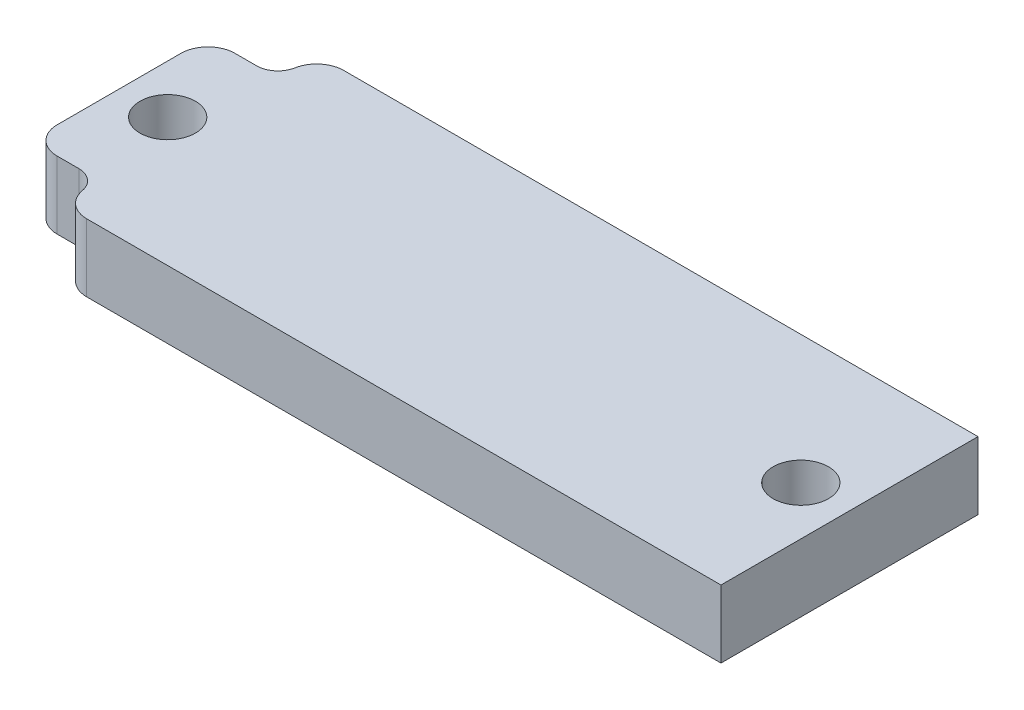
ISO-10303-21;
HEADER;
FILE_DESCRIPTION(('STEP AP214'),'2;1');
FILE_NAME('part.step','',(''),(''),'','','');
FILE_SCHEMA(('AUTOMOTIVE_DESIGN { 1 0 10303 214 1 1 1 1 }'));
ENDSEC;
DATA;
#1=APPLICATION_CONTEXT('core data for automotive mechanical design processes');
#2=APPLICATION_PROTOCOL_DEFINITION('international standard','automotive_design',2000,#1);
#3=PRODUCT_CONTEXT('',#1,'mechanical');
#4=PRODUCT('Part','Part','',(#3));
#5=PRODUCT_RELATED_PRODUCT_CATEGORY('part','',(#4));
#6=PRODUCT_DEFINITION_FORMATION('','',#4);
#7=PRODUCT_DEFINITION_CONTEXT('part definition',#1,'design');
#8=PRODUCT_DEFINITION('design','',#6,#7);
#9=PRODUCT_DEFINITION_SHAPE('','',#8);
#10=(LENGTH_UNIT() NAMED_UNIT(*) SI_UNIT(.MILLI.,.METRE.));
#11=(NAMED_UNIT(*) PLANE_ANGLE_UNIT() SI_UNIT($,.RADIAN.));
#12=(NAMED_UNIT(*) SI_UNIT($,.STERADIAN.) SOLID_ANGLE_UNIT());
#13=UNCERTAINTY_MEASURE_WITH_UNIT(LENGTH_MEASURE(1.E-05),#10,'distance_accuracy_value','');
#14=(GEOMETRIC_REPRESENTATION_CONTEXT(3) GLOBAL_UNCERTAINTY_ASSIGNED_CONTEXT((#13)) GLOBAL_UNIT_ASSIGNED_CONTEXT((#10,
#11,#12)) REPRESENTATION_CONTEXT('',''));
#15=CARTESIAN_POINT('',(0.,0.,0.));
#16=DIRECTION('',(0.,0.,1.));
#17=DIRECTION('',(1.,0.,0.));
#18=AXIS2_PLACEMENT_3D('',#15,#16,#17);
#19=CARTESIAN_POINT('',(0.,6.35,0.));
#20=DIRECTION('',(0.,-1.,0.));
#21=DIRECTION('',(0.,0.,-1.));
#22=AXIS2_PLACEMENT_3D('',#19,#20,#21);
#23=PLANE('',#22);
#24=CARTESIAN_POINT('',(4.57,6.35,-12.065));
#25=DIRECTION('',(0.,1.,0.));
#26=DIRECTION('',(0.,0.,1.));
#27=AXIS2_PLACEMENT_3D('',#24,#25,#26);
#28=CIRCLE('',#27,2.6);
#29=CARTESIAN_POINT('',(4.57,6.35,-9.465));
#30=VERTEX_POINT('',#29);
#31=EDGE_CURVE('E171',#30,#30,#28,.T.);
#32=ORIENTED_EDGE('',*,*,#31,.F.);
#33=EDGE_LOOP('',(#32));
#34=FACE_BOUND('',#33,.T.);
#35=CARTESIAN_POINT('',(64.01,6.35,-12.065));
#36=DIRECTION('',(0.,1.,0.));
#37=DIRECTION('',(0.,0.,1.));
#38=AXIS2_PLACEMENT_3D('',#35,#36,#37);
#39=CIRCLE('',#38,2.59999999999999);
#40=CARTESIAN_POINT('',(64.01,6.35,-9.46500000000001));
#41=VERTEX_POINT('',#40);
#42=EDGE_CURVE('E165',#41,#41,#39,.T.);
#43=ORIENTED_EDGE('',*,*,#42,.F.);
#44=EDGE_LOOP('',(#43));
#45=FACE_BOUND('',#44,.T.);
#46=CARTESIAN_POINT('',(4.57,6.35,-1.715));
#47=DIRECTION('',(0.,1.,0.));
#48=DIRECTION('',(0.,0.,1.));
#49=AXIS2_PLACEMENT_3D('',#46,#47,#48);
#50=CIRCLE('',#49,2.);
#51=CARTESIAN_POINT('',(4.57,6.35,-3.715));
#52=VERTEX_POINT('',#51);
#53=CARTESIAN_POINT('',(6.53670134597141,6.35,-2.07843612334802));
#54=VERTEX_POINT('',#53);
#55=EDGE_CURVE('E137',#52,#54,#50,.F.);
#56=ORIENTED_EDGE('',*,*,#55,.T.);
#57=CARTESIAN_POINT('',(9.03441205535511,6.35,-2.54));
#58=DIRECTION('',(0.,-1.,0.));
#59=DIRECTION('',(0.,0.,-1.));
#60=AXIS2_PLACEMENT_3D('',#57,#58,#59);
#61=CIRCLE('',#60,2.54);
#62=CARTESIAN_POINT('',(9.03441205535511,6.35,0.));
#63=VERTEX_POINT('',#62);
#64=EDGE_CURVE('E210',#54,#63,#61,.F.);
#65=ORIENTED_EDGE('',*,*,#64,.T.);
#66=DIRECTION('',(1.,0.,0.));
#67=VECTOR('',#66,1.);
#68=CARTESIAN_POINT('',(0.,6.35,0.));
#69=LINE('',#68,#67);
#70=CARTESIAN_POINT('',(68.58,6.35,0.));
#71=VERTEX_POINT('',#70);
#72=EDGE_CURVE('E180',#63,#71,#69,.T.);
#73=ORIENTED_EDGE('',*,*,#72,.T.);
#74=DIRECTION('',(0.,0.,-1.));
#75=VECTOR('',#74,1.);
#76=CARTESIAN_POINT('',(68.58,6.35,0.));
#77=LINE('',#76,#75);
#78=CARTESIAN_POINT('',(68.58,6.35,-24.13));
#79=VERTEX_POINT('',#78);
#80=EDGE_CURVE('E183',#71,#79,#77,.T.);
#81=ORIENTED_EDGE('',*,*,#80,.T.);
#82=DIRECTION('',(-1.,0.,0.));
#83=VECTOR('',#82,1.);
#84=CARTESIAN_POINT('',(0.,6.35,-24.13));
#85=LINE('',#84,#83);
#86=CARTESIAN_POINT('',(9.03441205535511,6.35,-24.13));
#87=VERTEX_POINT('',#86);
#88=EDGE_CURVE('E185',#79,#87,#85,.T.);
#89=ORIENTED_EDGE('',*,*,#88,.T.);
#90=CARTESIAN_POINT('',(9.03441205535511,6.35,-21.59));
#91=DIRECTION('',(0.,-1.,0.));
#92=DIRECTION('',(0.,0.,-1.));
#93=AXIS2_PLACEMENT_3D('',#90,#91,#92);
#94=CIRCLE('',#93,2.54);
#95=CARTESIAN_POINT('',(6.53670134597141,6.35,-22.051563876652));
#96=VERTEX_POINT('',#95);
#97=EDGE_CURVE('E204',#87,#96,#94,.F.);
#98=ORIENTED_EDGE('',*,*,#97,.T.);
#99=CARTESIAN_POINT('',(4.57,6.35,-22.415));
#100=DIRECTION('',(0.,1.,0.));
#101=DIRECTION('',(0.,0.,1.));
#102=AXIS2_PLACEMENT_3D('',#99,#100,#101);
#103=CIRCLE('',#102,2.);
#104=CARTESIAN_POINT('',(4.57,6.35,-20.415));
#105=VERTEX_POINT('',#104);
#106=EDGE_CURVE('E148',#105,#96,#103,.T.);
#107=ORIENTED_EDGE('',*,*,#106,.F.);
#108=DIRECTION('',(-1.,0.,0.));
#109=VECTOR('',#108,1.);
#110=CARTESIAN_POINT('',(0.,6.35,-20.415));
#111=LINE('',#110,#109);
#112=CARTESIAN_POINT('',(2.54,6.35,-20.415));
#113=VERTEX_POINT('',#112);
#114=EDGE_CURVE('E133',#105,#113,#111,.T.);
#115=ORIENTED_EDGE('',*,*,#114,.T.);
#116=CARTESIAN_POINT('',(2.54,6.35,-17.875));
#117=DIRECTION('',(0.,-1.,0.));
#118=DIRECTION('',(0.,0.,-1.));
#119=AXIS2_PLACEMENT_3D('',#116,#117,#118);
#120=CIRCLE('',#119,2.54);
#121=CARTESIAN_POINT('',(0.,6.35,-17.875));
#122=VERTEX_POINT('',#121);
#123=EDGE_CURVE('E206',#113,#122,#120,.F.);
#124=ORIENTED_EDGE('',*,*,#123,.T.);
#125=DIRECTION('',(0.,0.,1.));
#126=VECTOR('',#125,1.);
#127=CARTESIAN_POINT('',(0.,6.35,0.));
#128=LINE('',#127,#126);
#129=CARTESIAN_POINT('',(0.,6.35,-6.255));
#130=VERTEX_POINT('',#129);
#131=EDGE_CURVE('E177',#122,#130,#128,.T.);
#132=ORIENTED_EDGE('',*,*,#131,.T.);
#133=CARTESIAN_POINT('',(2.54,6.35,-6.255));
#134=DIRECTION('',(0.,-1.,0.));
#135=DIRECTION('',(0.,0.,-1.));
#136=AXIS2_PLACEMENT_3D('',#133,#134,#135);
#137=CIRCLE('',#136,2.54);
#138=CARTESIAN_POINT('',(2.54,6.35,-3.715));
#139=VERTEX_POINT('',#138);
#140=EDGE_CURVE('E208',#130,#139,#137,.F.);
#141=ORIENTED_EDGE('',*,*,#140,.T.);
#142=DIRECTION('',(-1.,0.,0.));
#143=VECTOR('',#142,1.);
#144=CARTESIAN_POINT('',(0.,6.35,-3.715));
#145=LINE('',#144,#143);
#146=EDGE_CURVE('E157',#52,#139,#145,.T.);
#147=ORIENTED_EDGE('',*,*,#146,.F.);
#148=EDGE_LOOP('',(#56,#65,#73,#81,#89,#98,#107,#115,#124,#132,#141,#147));
#149=FACE_BOUND('',#148,.T.);
#150=ADVANCED_FACE('F33',(#34,#45,#149),#23,.F.);
#151=CARTESIAN_POINT('',(0.,0.,0.));
#152=DIRECTION('',(0.,-1.,0.));
#153=DIRECTION('',(0.,0.,-1.));
#154=AXIS2_PLACEMENT_3D('',#151,#152,#153);
#155=PLANE('',#154);
#156=CARTESIAN_POINT('',(4.57,0.,-12.065));
#157=DIRECTION('',(0.,1.,0.));
#158=DIRECTION('',(0.,0.,1.));
#159=AXIS2_PLACEMENT_3D('',#156,#157,#158);
#160=CIRCLE('',#159,2.6);
#161=CARTESIAN_POINT('',(4.57,0.,-9.465));
#162=VERTEX_POINT('',#161);
#163=EDGE_CURVE('E168',#162,#162,#160,.T.);
#164=ORIENTED_EDGE('',*,*,#163,.T.);
#165=EDGE_LOOP('',(#164));
#166=FACE_BOUND('',#165,.T.);
#167=CARTESIAN_POINT('',(64.01,0.,-12.065));
#168=DIRECTION('',(0.,1.,0.));
#169=DIRECTION('',(0.,0.,1.));
#170=AXIS2_PLACEMENT_3D('',#167,#168,#169);
#171=CIRCLE('',#170,2.59999999999999);
#172=CARTESIAN_POINT('',(64.01,0.,-9.46500000000001));
#173=VERTEX_POINT('',#172);
#174=EDGE_CURVE('E164',#173,#173,#171,.T.);
#175=ORIENTED_EDGE('',*,*,#174,.T.);
#176=EDGE_LOOP('',(#175));
#177=FACE_BOUND('',#176,.T.);
#178=DIRECTION('',(1.,0.,0.));
#179=VECTOR('',#178,1.);
#180=CARTESIAN_POINT('',(0.,0.,0.));
#181=LINE('',#180,#179);
#182=CARTESIAN_POINT('',(9.03441205535511,0.,0.));
#183=VERTEX_POINT('',#182);
#184=CARTESIAN_POINT('',(68.58,0.,0.));
#185=VERTEX_POINT('',#184);
#186=EDGE_CURVE('E191',#183,#185,#181,.T.);
#187=ORIENTED_EDGE('',*,*,#186,.F.);
#188=CARTESIAN_POINT('',(9.03441205535511,0.,-2.54));
#189=DIRECTION('',(0.,-1.,0.));
#190=DIRECTION('',(0.,0.,-1.));
#191=AXIS2_PLACEMENT_3D('',#188,#189,#190);
#192=CIRCLE('',#191,2.54);
#193=CARTESIAN_POINT('',(6.53670134597141,0.,-2.07843612334802));
#194=VERTEX_POINT('',#193);
#195=EDGE_CURVE('E218',#183,#194,#192,.T.);
#196=ORIENTED_EDGE('',*,*,#195,.T.);
#197=CARTESIAN_POINT('',(4.57,0.,-1.715));
#198=DIRECTION('',(0.,1.,0.));
#199=DIRECTION('',(0.,0.,1.));
#200=AXIS2_PLACEMENT_3D('',#197,#198,#199);
#201=CIRCLE('',#200,2.);
#202=CARTESIAN_POINT('',(4.57,0.,-3.715));
#203=VERTEX_POINT('',#202);
#204=EDGE_CURVE('E153',#203,#194,#201,.F.);
#205=ORIENTED_EDGE('',*,*,#204,.F.);
#206=DIRECTION('',(-1.,0.,0.));
#207=VECTOR('',#206,1.);
#208=CARTESIAN_POINT('',(0.,0.,-3.715));
#209=LINE('',#208,#207);
#210=CARTESIAN_POINT('',(2.54,0.,-3.715));
#211=VERTEX_POINT('',#210);
#212=EDGE_CURVE('E156',#203,#211,#209,.T.);
#213=ORIENTED_EDGE('',*,*,#212,.T.);
#214=CARTESIAN_POINT('',(2.54,0.,-6.255));
#215=DIRECTION('',(0.,-1.,0.));
#216=DIRECTION('',(0.,0.,-1.));
#217=AXIS2_PLACEMENT_3D('',#214,#215,#216);
#218=CIRCLE('',#217,2.54);
#219=CARTESIAN_POINT('',(0.,0.,-6.255));
#220=VERTEX_POINT('',#219);
#221=EDGE_CURVE('E216',#211,#220,#218,.T.);
#222=ORIENTED_EDGE('',*,*,#221,.T.);
#223=DIRECTION('',(0.,0.,1.));
#224=VECTOR('',#223,1.);
#225=CARTESIAN_POINT('',(0.,0.,0.));
#226=LINE('',#225,#224);
#227=CARTESIAN_POINT('',(0.,0.,-17.875));
#228=VERTEX_POINT('',#227);
#229=EDGE_CURVE('E174',#228,#220,#226,.T.);
#230=ORIENTED_EDGE('',*,*,#229,.F.);
#231=CARTESIAN_POINT('',(2.54,0.,-17.875));
#232=DIRECTION('',(0.,-1.,0.));
#233=DIRECTION('',(0.,0.,-1.));
#234=AXIS2_PLACEMENT_3D('',#231,#232,#233);
#235=CIRCLE('',#234,2.54);
#236=CARTESIAN_POINT('',(2.54,0.,-20.415));
#237=VERTEX_POINT('',#236);
#238=EDGE_CURVE('E147',#228,#237,#235,.T.);
#239=ORIENTED_EDGE('',*,*,#238,.T.);
#240=DIRECTION('',(-1.,0.,0.));
#241=VECTOR('',#240,1.);
#242=CARTESIAN_POINT('',(0.,0.,-20.415));
#243=LINE('',#242,#241);
#244=CARTESIAN_POINT('',(4.57,0.,-20.415));
#245=VERTEX_POINT('',#244);
#246=EDGE_CURVE('E130',#245,#237,#243,.T.);
#247=ORIENTED_EDGE('',*,*,#246,.F.);
#248=CARTESIAN_POINT('',(4.57,0.,-22.415));
#249=DIRECTION('',(0.,1.,0.));
#250=DIRECTION('',(0.,0.,1.));
#251=AXIS2_PLACEMENT_3D('',#248,#249,#250);
#252=CIRCLE('',#251,2.);
#253=CARTESIAN_POINT('',(6.53670134597141,0.,-22.051563876652));
#254=VERTEX_POINT('',#253);
#255=EDGE_CURVE('E138',#245,#254,#252,.T.);
#256=ORIENTED_EDGE('',*,*,#255,.T.);
#257=CARTESIAN_POINT('',(9.03441205535511,0.,-21.59));
#258=DIRECTION('',(0.,-1.,0.));
#259=DIRECTION('',(0.,0.,-1.));
#260=AXIS2_PLACEMENT_3D('',#257,#258,#259);
#261=CIRCLE('',#260,2.54);
#262=CARTESIAN_POINT('',(9.03441205535511,0.,-24.13));
#263=VERTEX_POINT('',#262);
#264=EDGE_CURVE('E56',#254,#263,#261,.T.);
#265=ORIENTED_EDGE('',*,*,#264,.T.);
#266=DIRECTION('',(-1.,0.,0.));
#267=VECTOR('',#266,1.);
#268=CARTESIAN_POINT('',(0.,0.,-24.13));
#269=LINE('',#268,#267);
#270=CARTESIAN_POINT('',(68.58,0.,-24.13));
#271=VERTEX_POINT('',#270);
#272=EDGE_CURVE('E181',#271,#263,#269,.T.);
#273=ORIENTED_EDGE('',*,*,#272,.F.);
#274=DIRECTION('',(0.,0.,-1.));
#275=VECTOR('',#274,1.);
#276=CARTESIAN_POINT('',(68.58,0.,0.));
#277=LINE('',#276,#275);
#278=EDGE_CURVE('E193',#185,#271,#277,.T.);
#279=ORIENTED_EDGE('',*,*,#278,.F.);
#280=EDGE_LOOP('',(#187,#196,#205,#213,#222,#230,#239,#247,#256,#265,#273,#279));
#281=FACE_BOUND('',#280,.T.);
#282=ADVANCED_FACE('F144',(#166,#177,#281),#155,.T.);
#283=CARTESIAN_POINT('',(0.,6.35,0.));
#284=DIRECTION('',(1.,0.,0.));
#285=DIRECTION('',(0.,0.,-1.));
#286=AXIS2_PLACEMENT_3D('',#283,#284,#285);
#287=PLANE('',#286);
#288=ORIENTED_EDGE('',*,*,#229,.T.);
#289=DIRECTION('',(0.,1.,0.));
#290=VECTOR('',#289,1.);
#291=CARTESIAN_POINT('',(0.,6.35,-6.255));
#292=LINE('',#291,#290);
#293=EDGE_CURVE('E222',#220,#130,#292,.T.);
#294=ORIENTED_EDGE('',*,*,#293,.T.);
#295=ORIENTED_EDGE('',*,*,#131,.F.);
#296=DIRECTION('',(0.,1.,0.));
#297=VECTOR('',#296,1.);
#298=CARTESIAN_POINT('',(0.,0.,-17.875));
#299=LINE('',#298,#297);
#300=EDGE_CURVE('E220',#122,#228,#299,.F.);
#301=ORIENTED_EDGE('',*,*,#300,.T.);
#302=EDGE_LOOP('',(#288,#294,#295,#301));
#303=FACE_BOUND('',#302,.T.);
#304=ADVANCED_FACE('F258',(#303),#287,.F.);
#305=CARTESIAN_POINT('',(0.,6.35,0.));
#306=DIRECTION('',(0.,0.,-1.));
#307=DIRECTION('',(-1.,0.,0.));
#308=AXIS2_PLACEMENT_3D('',#305,#306,#307);
#309=PLANE('',#308);
#310=ORIENTED_EDGE('',*,*,#72,.F.);
#311=DIRECTION('',(0.,-1.,0.));
#312=VECTOR('',#311,1.);
#313=CARTESIAN_POINT('',(9.03441205535511,0.,0.));
#314=LINE('',#313,#312);
#315=EDGE_CURVE('E212',#63,#183,#314,.T.);
#316=ORIENTED_EDGE('',*,*,#315,.T.);
#317=ORIENTED_EDGE('',*,*,#186,.T.);
#318=DIRECTION('',(0.,-1.,0.));
#319=VECTOR('',#318,1.);
#320=CARTESIAN_POINT('',(68.58,6.35,0.));
#321=LINE('',#320,#319);
#322=EDGE_CURVE('E198',#71,#185,#321,.T.);
#323=ORIENTED_EDGE('',*,*,#322,.F.);
#324=EDGE_LOOP('',(#310,#316,#317,#323));
#325=FACE_BOUND('',#324,.T.);
#326=ADVANCED_FACE('F285',(#325),#309,.F.);
#327=CARTESIAN_POINT('',(68.58,6.35,0.));
#328=DIRECTION('',(-1.,0.,0.));
#329=DIRECTION('',(0.,0.,1.));
#330=AXIS2_PLACEMENT_3D('',#327,#328,#329);
#331=PLANE('',#330);
#332=ORIENTED_EDGE('',*,*,#278,.T.);
#333=DIRECTION('',(0.,-1.,0.));
#334=VECTOR('',#333,1.);
#335=CARTESIAN_POINT('',(68.58,6.35,-24.13));
#336=LINE('',#335,#334);
#337=EDGE_CURVE('E188',#79,#271,#336,.T.);
#338=ORIENTED_EDGE('',*,*,#337,.F.);
#339=ORIENTED_EDGE('',*,*,#80,.F.);
#340=ORIENTED_EDGE('',*,*,#322,.T.);
#341=EDGE_LOOP('',(#332,#338,#339,#340));
#342=FACE_BOUND('',#341,.T.);
#343=ADVANCED_FACE('F239',(#342),#331,.F.);
#344=CARTESIAN_POINT('',(0.,6.35,-24.13));
#345=DIRECTION('',(0.,0.,1.));
#346=DIRECTION('',(1.,0.,0.));
#347=AXIS2_PLACEMENT_3D('',#344,#345,#346);
#348=PLANE('',#347);
#349=ORIENTED_EDGE('',*,*,#272,.T.);
#350=DIRECTION('',(0.,1.,0.));
#351=VECTOR('',#350,1.);
#352=CARTESIAN_POINT('',(9.03441205535511,6.35,-24.13));
#353=LINE('',#352,#351);
#354=EDGE_CURVE('E41',#263,#87,#353,.T.);
#355=ORIENTED_EDGE('',*,*,#354,.T.);
#356=ORIENTED_EDGE('',*,*,#88,.F.);
#357=ORIENTED_EDGE('',*,*,#337,.T.);
#358=EDGE_LOOP('',(#349,#355,#356,#357));
#359=FACE_BOUND('',#358,.T.);
#360=ADVANCED_FACE('F231',(#359),#348,.F.);
#361=CARTESIAN_POINT('',(4.57,6.35,-12.065));
#362=DIRECTION('',(0.,-1.,0.));
#363=DIRECTION('',(0.,0.,-1.));
#364=AXIS2_PLACEMENT_3D('',#361,#362,#363);
#365=CYLINDRICAL_SURFACE('',#364,2.6);
#366=ORIENTED_EDGE('',*,*,#31,.T.);
#367=EDGE_LOOP('',(#366));
#368=FACE_BOUND('',#367,.T.);
#369=ORIENTED_EDGE('',*,*,#163,.F.);
#370=EDGE_LOOP('',(#369));
#371=FACE_BOUND('',#370,.T.);
#372=ADVANCED_FACE('F278',(#368,#371),#365,.F.);
#373=CARTESIAN_POINT('',(64.01,6.35,-12.065));
#374=DIRECTION('',(0.,-1.,0.));
#375=DIRECTION('',(0.,0.,-1.));
#376=AXIS2_PLACEMENT_3D('',#373,#374,#375);
#377=CYLINDRICAL_SURFACE('',#376,2.59999999999999);
#378=ORIENTED_EDGE('',*,*,#42,.T.);
#379=EDGE_LOOP('',(#378));
#380=FACE_BOUND('',#379,.T.);
#381=ORIENTED_EDGE('',*,*,#174,.F.);
#382=EDGE_LOOP('',(#381));
#383=FACE_BOUND('',#382,.T.);
#384=ADVANCED_FACE('F342',(#380,#383),#377,.F.);
#385=CARTESIAN_POINT('',(4.57,0.,-1.715));
#386=DIRECTION('',(0.,1.,0.));
#387=DIRECTION('',(0.,0.,1.));
#388=AXIS2_PLACEMENT_3D('',#385,#386,#387);
#389=CYLINDRICAL_SURFACE('',#388,2.);
#390=ORIENTED_EDGE('',*,*,#204,.T.);
#391=DIRECTION('',(0.,1.,0.));
#392=VECTOR('',#391,1.);
#393=CARTESIAN_POINT('',(6.53670134597141,0.,-2.07843612334802));
#394=LINE('',#393,#392);
#395=EDGE_CURVE('E201',#194,#54,#394,.T.);
#396=ORIENTED_EDGE('',*,*,#395,.T.);
#397=ORIENTED_EDGE('',*,*,#55,.F.);
#398=DIRECTION('',(0.,1.,0.));
#399=VECTOR('',#398,1.);
#400=CARTESIAN_POINT('',(4.57,0.,-3.715));
#401=LINE('',#400,#399);
#402=EDGE_CURVE('E159',#203,#52,#401,.T.);
#403=ORIENTED_EDGE('',*,*,#402,.F.);
#404=EDGE_LOOP('',(#390,#396,#397,#403));
#405=FACE_BOUND('',#404,.T.);
#406=ADVANCED_FACE('F250',(#405),#389,.F.);
#407=CARTESIAN_POINT('',(0.,0.,-3.715));
#408=DIRECTION('',(0.,0.,-1.));
#409=DIRECTION('',(-1.,0.,0.));
#410=AXIS2_PLACEMENT_3D('',#407,#408,#409);
#411=PLANE('',#410);
#412=ORIENTED_EDGE('',*,*,#146,.T.);
#413=DIRECTION('',(0.,1.,0.));
#414=VECTOR('',#413,1.);
#415=CARTESIAN_POINT('',(2.54,0.,-3.715));
#416=LINE('',#415,#414);
#417=EDGE_CURVE('E48',#139,#211,#416,.F.);
#418=ORIENTED_EDGE('',*,*,#417,.T.);
#419=ORIENTED_EDGE('',*,*,#212,.F.);
#420=ORIENTED_EDGE('',*,*,#402,.T.);
#421=EDGE_LOOP('',(#412,#418,#419,#420));
#422=FACE_BOUND('',#421,.T.);
#423=ADVANCED_FACE('F252',(#422),#411,.F.);
#424=CARTESIAN_POINT('',(0.,0.,-20.415));
#425=DIRECTION('',(0.,0.,-1.));
#426=DIRECTION('',(-1.,0.,0.));
#427=AXIS2_PLACEMENT_3D('',#424,#425,#426);
#428=PLANE('',#427);
#429=ORIENTED_EDGE('',*,*,#246,.T.);
#430=DIRECTION('',(0.,1.,0.));
#431=VECTOR('',#430,1.);
#432=CARTESIAN_POINT('',(2.54,6.35,-20.415));
#433=LINE('',#432,#431);
#434=EDGE_CURVE('E226',#237,#113,#433,.T.);
#435=ORIENTED_EDGE('',*,*,#434,.T.);
#436=ORIENTED_EDGE('',*,*,#114,.F.);
#437=DIRECTION('',(0.,1.,0.));
#438=VECTOR('',#437,1.);
#439=CARTESIAN_POINT('',(4.57,0.,-20.415));
#440=LINE('',#439,#438);
#441=EDGE_CURVE('E125',#245,#105,#440,.T.);
#442=ORIENTED_EDGE('',*,*,#441,.F.);
#443=EDGE_LOOP('',(#429,#435,#436,#442));
#444=FACE_BOUND('',#443,.T.);
#445=ADVANCED_FACE('F127',(#444),#428,.T.);
#446=CARTESIAN_POINT('',(4.57,0.,-22.415));
#447=DIRECTION('',(0.,1.,0.));
#448=DIRECTION('',(0.,0.,1.));
#449=AXIS2_PLACEMENT_3D('',#446,#447,#448);
#450=CYLINDRICAL_SURFACE('',#449,2.);
#451=ORIENTED_EDGE('',*,*,#106,.T.);
#452=DIRECTION('',(0.,1.,0.));
#453=VECTOR('',#452,1.);
#454=CARTESIAN_POINT('',(6.53670134597141,0.,-22.051563876652));
#455=LINE('',#454,#453);
#456=EDGE_CURVE('E11',#96,#254,#455,.F.);
#457=ORIENTED_EDGE('',*,*,#456,.T.);
#458=ORIENTED_EDGE('',*,*,#255,.F.);
#459=ORIENTED_EDGE('',*,*,#441,.T.);
#460=EDGE_LOOP('',(#451,#457,#458,#459));
#461=FACE_BOUND('',#460,.T.);
#462=ADVANCED_FACE('F140',(#461),#450,.F.);
#463=CARTESIAN_POINT('',(9.03441205535511,0.,-2.54));
#464=DIRECTION('',(0.,1.,0.));
#465=DIRECTION('',(0.,0.,1.));
#466=AXIS2_PLACEMENT_3D('',#463,#464,#465);
#467=CYLINDRICAL_SURFACE('',#466,2.54);
#468=ORIENTED_EDGE('',*,*,#195,.F.);
#469=ORIENTED_EDGE('',*,*,#315,.F.);
#470=ORIENTED_EDGE('',*,*,#64,.F.);
#471=ORIENTED_EDGE('',*,*,#395,.F.);
#472=EDGE_LOOP('',(#468,#469,#470,#471));
#473=FACE_BOUND('',#472,.T.);
#474=ADVANCED_FACE('F247',(#473),#467,.T.);
#475=CARTESIAN_POINT('',(2.54,6.35,-6.255));
#476=DIRECTION('',(0.,1.,0.));
#477=DIRECTION('',(0.,0.,1.));
#478=AXIS2_PLACEMENT_3D('',#475,#476,#477);
#479=CYLINDRICAL_SURFACE('',#478,2.54);
#480=ORIENTED_EDGE('',*,*,#221,.F.);
#481=ORIENTED_EDGE('',*,*,#417,.F.);
#482=ORIENTED_EDGE('',*,*,#140,.F.);
#483=ORIENTED_EDGE('',*,*,#293,.F.);
#484=EDGE_LOOP('',(#480,#481,#482,#483));
#485=FACE_BOUND('',#484,.T.);
#486=ADVANCED_FACE('F255',(#485),#479,.T.);
#487=CARTESIAN_POINT('',(2.54,0.,-17.875));
#488=DIRECTION('',(0.,-1.,0.));
#489=DIRECTION('',(0.,0.,-1.));
#490=AXIS2_PLACEMENT_3D('',#487,#488,#489);
#491=CYLINDRICAL_SURFACE('',#490,2.54);
#492=ORIENTED_EDGE('',*,*,#238,.F.);
#493=ORIENTED_EDGE('',*,*,#300,.F.);
#494=ORIENTED_EDGE('',*,*,#123,.F.);
#495=ORIENTED_EDGE('',*,*,#434,.F.);
#496=EDGE_LOOP('',(#492,#493,#494,#495));
#497=FACE_BOUND('',#496,.T.);
#498=ADVANCED_FACE('F262',(#497),#491,.T.);
#499=CARTESIAN_POINT('',(9.03441205535511,0.,-21.59));
#500=DIRECTION('',(0.,1.,0.));
#501=DIRECTION('',(0.,0.,1.));
#502=AXIS2_PLACEMENT_3D('',#499,#500,#501);
#503=CYLINDRICAL_SURFACE('',#502,2.54);
#504=ORIENTED_EDGE('',*,*,#264,.F.);
#505=ORIENTED_EDGE('',*,*,#456,.F.);
#506=ORIENTED_EDGE('',*,*,#97,.F.);
#507=ORIENTED_EDGE('',*,*,#354,.F.);
#508=EDGE_LOOP('',(#504,#505,#506,#507));
#509=FACE_BOUND('',#508,.T.);
#510=ADVANCED_FACE('F35',(#509),#503,.T.);
#511=CLOSED_SHELL('',(#150,#282,#304,#326,#343,#360,#372,#384,#406,#423,#445,#462,#474,#486,
#498,#510));
#512=MANIFOLD_SOLID_BREP('B2',#511);
#513=ADVANCED_BREP_SHAPE_REPRESENTATION('',(#18,#512),#14);
#514=SHAPE_DEFINITION_REPRESENTATION(#9,#513);
ENDSEC;
END-ISO-10303-21;
